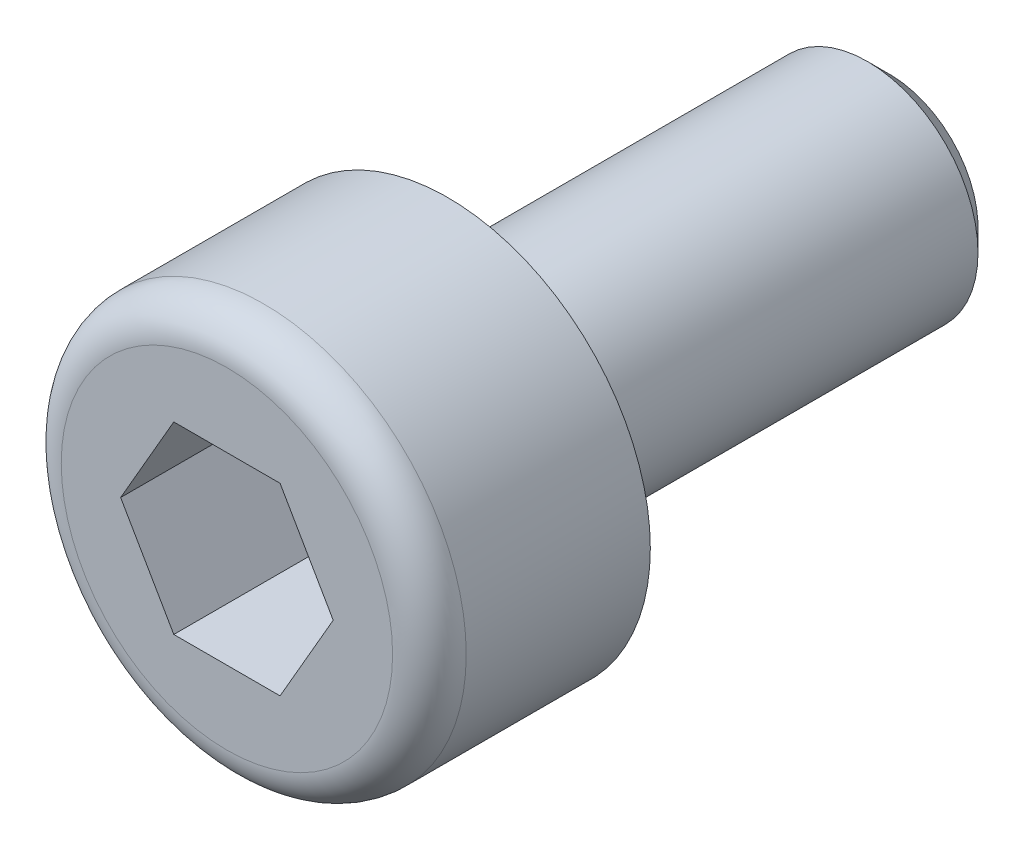
ISO-10303-21;
HEADER;
FILE_DESCRIPTION(('STEP AP214'),'2;1');
FILE_NAME('part.step','',(''),(''),'','','');
FILE_SCHEMA(('AUTOMOTIVE_DESIGN { 1 0 10303 214 1 1 1 1 }'));
ENDSEC;
DATA;
#1=APPLICATION_CONTEXT('core data for automotive mechanical design processes');
#2=APPLICATION_PROTOCOL_DEFINITION('international standard','automotive_design',2000,#1);
#3=PRODUCT_CONTEXT('',#1,'mechanical');
#4=PRODUCT('Part','Part','',(#3));
#5=PRODUCT_RELATED_PRODUCT_CATEGORY('part','',(#4));
#6=PRODUCT_DEFINITION_FORMATION('','',#4);
#7=PRODUCT_DEFINITION_CONTEXT('part definition',#1,'design');
#8=PRODUCT_DEFINITION('design','',#6,#7);
#9=PRODUCT_DEFINITION_SHAPE('','',#8);
#10=(LENGTH_UNIT() NAMED_UNIT(*) SI_UNIT(.MILLI.,.METRE.));
#11=(NAMED_UNIT(*) PLANE_ANGLE_UNIT() SI_UNIT($,.RADIAN.));
#12=(NAMED_UNIT(*) SI_UNIT($,.STERADIAN.) SOLID_ANGLE_UNIT());
#13=UNCERTAINTY_MEASURE_WITH_UNIT(LENGTH_MEASURE(1.E-05),#10,'distance_accuracy_value','');
#14=(GEOMETRIC_REPRESENTATION_CONTEXT(3) GLOBAL_UNCERTAINTY_ASSIGNED_CONTEXT((#13)) GLOBAL_UNIT_ASSIGNED_CONTEXT((#10,
#11,#12)) REPRESENTATION_CONTEXT('',''));
#15=CARTESIAN_POINT('',(0.,0.,0.));
#16=DIRECTION('',(0.,0.,1.));
#17=DIRECTION('',(1.,0.,0.));
#18=AXIS2_PLACEMENT_3D('',#15,#16,#17);
#19=CARTESIAN_POINT('',(0.,0.,0.));
#20=DIRECTION('',(0.,0.,1.));
#21=DIRECTION('',(1.,0.,0.));
#22=AXIS2_PLACEMENT_3D('',#19,#20,#21);
#23=PLANE('',#22);
#24=CARTESIAN_POINT('',(0.,0.,0.));
#25=DIRECTION('',(0.,0.,1.));
#26=DIRECTION('',(1.,0.,0.));
#27=AXIS2_PLACEMENT_3D('',#24,#25,#26);
#28=CIRCLE('',#27,2.75);
#29=CARTESIAN_POINT('',(2.75,0.,0.));
#30=VERTEX_POINT('',#29);
#31=EDGE_CURVE('E138',#30,#30,#28,.T.);
#32=ORIENTED_EDGE('',*,*,#31,.F.);
#33=EDGE_LOOP('',(#32));
#34=FACE_BOUND('',#33,.T.);
#35=CARTESIAN_POINT('',(0.,0.,0.));
#36=DIRECTION('',(0.,0.,1.));
#37=DIRECTION('',(1.,0.,0.));
#38=AXIS2_PLACEMENT_3D('',#35,#36,#37);
#39=CIRCLE('',#38,1.5);
#40=CARTESIAN_POINT('',(1.5,0.,0.));
#41=VERTEX_POINT('',#40);
#42=EDGE_CURVE('E146',#41,#41,#39,.F.);
#43=ORIENTED_EDGE('',*,*,#42,.F.);
#44=EDGE_LOOP('',(#43));
#45=FACE_BOUND('',#44,.T.);
#46=ADVANCED_FACE('F36',(#34,#45),#23,.F.);
#47=CARTESIAN_POINT('',(0.,0.,3.));
#48=DIRECTION('',(0.,0.,-1.));
#49=DIRECTION('',(-1.,0.,0.));
#50=AXIS2_PLACEMENT_3D('',#47,#48,#49);
#51=CYLINDRICAL_SURFACE('',#50,2.75);
#52=CARTESIAN_POINT('',(0.,0.,2.5));
#53=DIRECTION('',(0.,0.,1.));
#54=DIRECTION('',(1.,0.,0.));
#55=AXIS2_PLACEMENT_3D('',#52,#53,#54);
#56=CIRCLE('',#55,2.75);
#57=CARTESIAN_POINT('',(2.75,0.,2.5));
#58=VERTEX_POINT('',#57);
#59=EDGE_CURVE('E11',#58,#58,#56,.F.);
#60=ORIENTED_EDGE('',*,*,#59,.T.);
#61=EDGE_LOOP('',(#60));
#62=FACE_BOUND('',#61,.T.);
#63=ORIENTED_EDGE('',*,*,#31,.T.);
#64=EDGE_LOOP('',(#63));
#65=FACE_BOUND('',#64,.T.);
#66=ADVANCED_FACE('F170',(#62,#65),#51,.T.);
#67=CARTESIAN_POINT('',(0.,0.,3.));
#68=DIRECTION('',(0.,0.,1.));
#69=DIRECTION('',(1.,0.,0.));
#70=AXIS2_PLACEMENT_3D('',#67,#68,#69);
#71=PLANE('',#70);
#72=CARTESIAN_POINT('',(0.,0.,3.));
#73=DIRECTION('',(0.,0.,1.));
#74=DIRECTION('',(1.,0.,0.));
#75=AXIS2_PLACEMENT_3D('',#72,#73,#74);
#76=CIRCLE('',#75,2.25);
#77=CARTESIAN_POINT('',(2.25,0.,3.));
#78=VERTEX_POINT('',#77);
#79=EDGE_CURVE('E44',#78,#78,#76,.T.);
#80=ORIENTED_EDGE('',*,*,#79,.T.);
#81=EDGE_LOOP('',(#80));
#82=FACE_BOUND('',#81,.T.);
#83=DIRECTION('',(-0.5,-0.866025403784439,0.));
#84=VECTOR('',#83,1.);
#85=CARTESIAN_POINT('',(-0.721687836487034,1.25,3.));
#86=LINE('',#85,#84);
#87=CARTESIAN_POINT('',(-0.721687836487034,1.25,3.));
#88=VERTEX_POINT('',#87);
#89=CARTESIAN_POINT('',(-1.44337567297407,0.,3.));
#90=VERTEX_POINT('',#89);
#91=EDGE_CURVE('E51',#88,#90,#86,.T.);
#92=ORIENTED_EDGE('',*,*,#91,.F.);
#93=DIRECTION('',(-1.,0.,0.));
#94=VECTOR('',#93,1.);
#95=CARTESIAN_POINT('',(0.721687836487032,1.25,3.));
#96=LINE('',#95,#94);
#97=CARTESIAN_POINT('',(0.721687836487032,1.25,3.));
#98=VERTEX_POINT('',#97);
#99=EDGE_CURVE('E134',#98,#88,#96,.T.);
#100=ORIENTED_EDGE('',*,*,#99,.F.);
#101=DIRECTION('',(-0.5,0.866025403784439,0.));
#102=VECTOR('',#101,1.);
#103=CARTESIAN_POINT('',(1.44337567297406,0.,3.));
#104=LINE('',#103,#102);
#105=CARTESIAN_POINT('',(1.44337567297406,0.,3.));
#106=VERTEX_POINT('',#105);
#107=EDGE_CURVE('E132',#106,#98,#104,.T.);
#108=ORIENTED_EDGE('',*,*,#107,.F.);
#109=DIRECTION('',(0.5,0.866025403784439,0.));
#110=VECTOR('',#109,1.);
#111=CARTESIAN_POINT('',(0.721687836487031,-1.25,3.));
#112=LINE('',#111,#110);
#113=CARTESIAN_POINT('',(0.721687836487031,-1.25,3.));
#114=VERTEX_POINT('',#113);
#115=EDGE_CURVE('E99',#114,#106,#112,.T.);
#116=ORIENTED_EDGE('',*,*,#115,.F.);
#117=DIRECTION('',(1.,0.,0.));
#118=VECTOR('',#117,1.);
#119=CARTESIAN_POINT('',(-0.721687836487034,-1.25,3.));
#120=LINE('',#119,#118);
#121=CARTESIAN_POINT('',(-0.721687836487034,-1.25,3.));
#122=VERTEX_POINT('',#121);
#123=EDGE_CURVE('E128',#122,#114,#120,.T.);
#124=ORIENTED_EDGE('',*,*,#123,.F.);
#125=DIRECTION('',(0.5,-0.866025403784439,0.));
#126=VECTOR('',#125,1.);
#127=CARTESIAN_POINT('',(-1.44337567297407,0.,3.));
#128=LINE('',#127,#126);
#129=EDGE_CURVE('E125',#90,#122,#128,.T.);
#130=ORIENTED_EDGE('',*,*,#129,.F.);
#131=EDGE_LOOP('',(#92,#100,#108,#116,#124,#130));
#132=FACE_BOUND('',#131,.T.);
#133=ADVANCED_FACE('F157',(#82,#132),#71,.T.);
#134=CARTESIAN_POINT('',(-0.721687836487034,1.25,1.));
#135=DIRECTION('',(-0.866025403784439,0.5,0.));
#136=DIRECTION('',(-0.5,-0.866025403784439,0.));
#137=AXIS2_PLACEMENT_3D('',#134,#135,#136);
#138=PLANE('',#137);
#139=ORIENTED_EDGE('',*,*,#91,.T.);
#140=DIRECTION('',(0.,0.,1.));
#141=VECTOR('',#140,1.);
#142=CARTESIAN_POINT('',(-1.44337567297407,0.,1.));
#143=LINE('',#142,#141);
#144=CARTESIAN_POINT('',(-1.44337567297407,0.,1.));
#145=VERTEX_POINT('',#144);
#146=EDGE_CURVE('E81',#145,#90,#143,.T.);
#147=ORIENTED_EDGE('',*,*,#146,.F.);
#148=DIRECTION('',(-0.5,-0.866025403784439,0.));
#149=VECTOR('',#148,1.);
#150=CARTESIAN_POINT('',(-0.721687836487034,1.25,1.));
#151=LINE('',#150,#149);
#152=CARTESIAN_POINT('',(-0.721687836487034,1.25,1.));
#153=VERTEX_POINT('',#152);
#154=EDGE_CURVE('E136',#153,#145,#151,.T.);
#155=ORIENTED_EDGE('',*,*,#154,.F.);
#156=DIRECTION('',(0.,0.,1.));
#157=VECTOR('',#156,1.);
#158=CARTESIAN_POINT('',(-0.721687836487034,1.25,1.));
#159=LINE('',#158,#157);
#160=EDGE_CURVE('E59',#153,#88,#159,.T.);
#161=ORIENTED_EDGE('',*,*,#160,.T.);
#162=EDGE_LOOP('',(#139,#147,#155,#161));
#163=FACE_BOUND('',#162,.T.);
#164=ADVANCED_FACE('F183',(#163),#138,.F.);
#165=CARTESIAN_POINT('',(0.721687836487032,1.25,1.));
#166=DIRECTION('',(0.,1.,0.));
#167=DIRECTION('',(-1.,0.,0.));
#168=AXIS2_PLACEMENT_3D('',#165,#166,#167);
#169=PLANE('',#168);
#170=ORIENTED_EDGE('',*,*,#99,.T.);
#171=ORIENTED_EDGE('',*,*,#160,.F.);
#172=DIRECTION('',(-1.,0.,0.));
#173=VECTOR('',#172,1.);
#174=CARTESIAN_POINT('',(0.721687836487032,1.25,1.));
#175=LINE('',#174,#173);
#176=CARTESIAN_POINT('',(0.721687836487032,1.25,1.));
#177=VERTEX_POINT('',#176);
#178=EDGE_CURVE('E111',#177,#153,#175,.T.);
#179=ORIENTED_EDGE('',*,*,#178,.F.);
#180=DIRECTION('',(0.,0.,1.));
#181=VECTOR('',#180,1.);
#182=CARTESIAN_POINT('',(0.721687836487032,1.25,1.));
#183=LINE('',#182,#181);
#184=EDGE_CURVE('E103',#177,#98,#183,.T.);
#185=ORIENTED_EDGE('',*,*,#184,.T.);
#186=EDGE_LOOP('',(#170,#171,#179,#185));
#187=FACE_BOUND('',#186,.T.);
#188=ADVANCED_FACE('F186',(#187),#169,.F.);
#189=CARTESIAN_POINT('',(1.44337567297406,0.,1.));
#190=DIRECTION('',(0.866025403784439,0.5,0.));
#191=DIRECTION('',(-0.5,0.866025403784439,0.));
#192=AXIS2_PLACEMENT_3D('',#189,#190,#191);
#193=PLANE('',#192);
#194=ORIENTED_EDGE('',*,*,#107,.T.);
#195=ORIENTED_EDGE('',*,*,#184,.F.);
#196=DIRECTION('',(-0.5,0.866025403784439,0.));
#197=VECTOR('',#196,1.);
#198=CARTESIAN_POINT('',(1.44337567297406,0.,1.));
#199=LINE('',#198,#197);
#200=CARTESIAN_POINT('',(1.44337567297406,0.,1.));
#201=VERTEX_POINT('',#200);
#202=EDGE_CURVE('E107',#201,#177,#199,.T.);
#203=ORIENTED_EDGE('',*,*,#202,.F.);
#204=DIRECTION('',(0.,0.,1.));
#205=VECTOR('',#204,1.);
#206=CARTESIAN_POINT('',(1.44337567297406,0.,1.));
#207=LINE('',#206,#205);
#208=EDGE_CURVE('E92',#201,#106,#207,.T.);
#209=ORIENTED_EDGE('',*,*,#208,.T.);
#210=EDGE_LOOP('',(#194,#195,#203,#209));
#211=FACE_BOUND('',#210,.T.);
#212=ADVANCED_FACE('F108',(#211),#193,.F.);
#213=CARTESIAN_POINT('',(0.721687836487031,-1.25,1.));
#214=DIRECTION('',(0.866025403784439,-0.5,0.));
#215=DIRECTION('',(0.5,0.866025403784439,0.));
#216=AXIS2_PLACEMENT_3D('',#213,#214,#215);
#217=PLANE('',#216);
#218=ORIENTED_EDGE('',*,*,#115,.T.);
#219=ORIENTED_EDGE('',*,*,#208,.F.);
#220=DIRECTION('',(0.5,0.866025403784439,0.));
#221=VECTOR('',#220,1.);
#222=CARTESIAN_POINT('',(0.721687836487031,-1.25,1.));
#223=LINE('',#222,#221);
#224=CARTESIAN_POINT('',(0.721687836487031,-1.25,1.));
#225=VERTEX_POINT('',#224);
#226=EDGE_CURVE('E96',#225,#201,#223,.T.);
#227=ORIENTED_EDGE('',*,*,#226,.F.);
#228=DIRECTION('',(0.,0.,1.));
#229=VECTOR('',#228,1.);
#230=CARTESIAN_POINT('',(0.721687836487031,-1.25,1.));
#231=LINE('',#230,#229);
#232=EDGE_CURVE('E104',#225,#114,#231,.T.);
#233=ORIENTED_EDGE('',*,*,#232,.T.);
#234=EDGE_LOOP('',(#218,#219,#227,#233));
#235=FACE_BOUND('',#234,.T.);
#236=ADVANCED_FACE('F94',(#235),#217,.F.);
#237=CARTESIAN_POINT('',(-0.721687836487034,-1.25,1.));
#238=DIRECTION('',(0.,-1.,0.));
#239=DIRECTION('',(1.,0.,0.));
#240=AXIS2_PLACEMENT_3D('',#237,#238,#239);
#241=PLANE('',#240);
#242=ORIENTED_EDGE('',*,*,#123,.T.);
#243=ORIENTED_EDGE('',*,*,#232,.F.);
#244=DIRECTION('',(1.,0.,0.));
#245=VECTOR('',#244,1.);
#246=CARTESIAN_POINT('',(-0.721687836487034,-1.25,1.));
#247=LINE('',#246,#245);
#248=CARTESIAN_POINT('',(-0.721687836487034,-1.25,1.));
#249=VERTEX_POINT('',#248);
#250=EDGE_CURVE('E117',#249,#225,#247,.T.);
#251=ORIENTED_EDGE('',*,*,#250,.F.);
#252=DIRECTION('',(0.,0.,1.));
#253=VECTOR('',#252,1.);
#254=CARTESIAN_POINT('',(-0.721687836487034,-1.25,1.));
#255=LINE('',#254,#253);
#256=EDGE_CURVE('E141',#249,#122,#255,.T.);
#257=ORIENTED_EDGE('',*,*,#256,.T.);
#258=EDGE_LOOP('',(#242,#243,#251,#257));
#259=FACE_BOUND('',#258,.T.);
#260=ADVANCED_FACE('F190',(#259),#241,.F.);
#261=CARTESIAN_POINT('',(-1.44337567297407,0.,1.));
#262=DIRECTION('',(-0.866025403784439,-0.5,0.));
#263=DIRECTION('',(0.5,-0.866025403784439,0.));
#264=AXIS2_PLACEMENT_3D('',#261,#262,#263);
#265=PLANE('',#264);
#266=ORIENTED_EDGE('',*,*,#129,.T.);
#267=ORIENTED_EDGE('',*,*,#256,.F.);
#268=DIRECTION('',(0.5,-0.866025403784439,0.));
#269=VECTOR('',#268,1.);
#270=CARTESIAN_POINT('',(-1.44337567297407,0.,1.));
#271=LINE('',#270,#269);
#272=EDGE_CURVE('E119',#145,#249,#271,.T.);
#273=ORIENTED_EDGE('',*,*,#272,.F.);
#274=ORIENTED_EDGE('',*,*,#146,.T.);
#275=EDGE_LOOP('',(#266,#267,#273,#274));
#276=FACE_BOUND('',#275,.T.);
#277=ADVANCED_FACE('F187',(#276),#265,.F.);
#278=CARTESIAN_POINT('',(0.,0.,1.));
#279=DIRECTION('',(0.,0.,1.));
#280=DIRECTION('',(1.,0.,0.));
#281=AXIS2_PLACEMENT_3D('',#278,#279,#280);
#282=PLANE('',#281);
#283=ORIENTED_EDGE('',*,*,#154,.T.);
#284=ORIENTED_EDGE('',*,*,#272,.T.);
#285=ORIENTED_EDGE('',*,*,#250,.T.);
#286=ORIENTED_EDGE('',*,*,#226,.T.);
#287=ORIENTED_EDGE('',*,*,#202,.T.);
#288=ORIENTED_EDGE('',*,*,#178,.T.);
#289=EDGE_LOOP('',(#283,#284,#285,#286,#287,#288));
#290=FACE_BOUND('',#289,.T.);
#291=ADVANCED_FACE('F114',(#290),#282,.T.);
#292=CARTESIAN_POINT('',(0.,0.,-6.));
#293=DIRECTION('',(0.,0.,1.));
#294=DIRECTION('',(1.,0.,0.));
#295=AXIS2_PLACEMENT_3D('',#292,#293,#294);
#296=CYLINDRICAL_SURFACE('',#295,1.5);
#297=CARTESIAN_POINT('',(0.,0.,-5.7));
#298=DIRECTION('',(0.,0.,-1.));
#299=DIRECTION('',(-1.,0.,0.));
#300=AXIS2_PLACEMENT_3D('',#297,#298,#299);
#301=CIRCLE('',#300,1.5);
#302=CARTESIAN_POINT('',(-1.5,0.,-5.7));
#303=VERTEX_POINT('',#302);
#304=EDGE_CURVE('E152',#303,#303,#301,.F.);
#305=ORIENTED_EDGE('',*,*,#304,.T.);
#306=EDGE_LOOP('',(#305));
#307=FACE_BOUND('',#306,.T.);
#308=ORIENTED_EDGE('',*,*,#42,.T.);
#309=EDGE_LOOP('',(#308));
#310=FACE_BOUND('',#309,.T.);
#311=ADVANCED_FACE('F203',(#307,#310),#296,.T.);
#312=CARTESIAN_POINT('',(0.,0.,-6.));
#313=DIRECTION('',(0.,0.,-1.));
#314=DIRECTION('',(-1.,0.,0.));
#315=AXIS2_PLACEMENT_3D('',#312,#313,#314);
#316=PLANE('',#315);
#317=CARTESIAN_POINT('',(0.,0.,-6.));
#318=DIRECTION('',(0.,0.,-1.));
#319=DIRECTION('',(-1.,0.,0.));
#320=AXIS2_PLACEMENT_3D('',#317,#318,#319);
#321=CIRCLE('',#320,1.2);
#322=CARTESIAN_POINT('',(-1.2,0.,-6.));
#323=VERTEX_POINT('',#322);
#324=EDGE_CURVE('E149',#323,#323,#321,.T.);
#325=ORIENTED_EDGE('',*,*,#324,.T.);
#326=EDGE_LOOP('',(#325));
#327=FACE_BOUND('',#326,.T.);
#328=ADVANCED_FACE('F166',(#327),#316,.T.);
#329=CARTESIAN_POINT('',(0.,0.,-6.));
#330=DIRECTION('',(0.,0.,1.));
#331=DIRECTION('',(1.,0.,0.));
#332=AXIS2_PLACEMENT_3D('',#329,#330,#331);
#333=CONICAL_SURFACE('',#332,1.2,0.785398163397447);
#334=ORIENTED_EDGE('',*,*,#304,.F.);
#335=EDGE_LOOP('',(#334));
#336=FACE_BOUND('',#335,.T.);
#337=ORIENTED_EDGE('',*,*,#324,.F.);
#338=EDGE_LOOP('',(#337));
#339=FACE_BOUND('',#338,.T.);
#340=ADVANCED_FACE('F161',(#336,#339),#333,.T.);
#341=CARTESIAN_POINT('',(0.,0.,2.5));
#342=DIRECTION('',(0.,0.,1.));
#343=DIRECTION('',(1.,0.,0.));
#344=AXIS2_PLACEMENT_3D('',#341,#342,#343);
#345=TOROIDAL_SURFACE('',#344,2.25,0.5);
#346=ORIENTED_EDGE('',*,*,#59,.F.);
#347=EDGE_LOOP('',(#346));
#348=FACE_BOUND('',#347,.T.);
#349=ORIENTED_EDGE('',*,*,#79,.F.);
#350=EDGE_LOOP('',(#349));
#351=FACE_BOUND('',#350,.T.);
#352=ADVANCED_FACE('F38',(#348,#351),#345,.T.);
#353=CLOSED_SHELL('',(#46,#66,#133,#164,#188,#212,#236,#260,#277,#291,#311,#328,#340,#352));
#354=MANIFOLD_SOLID_BREP('B2',#353);
#355=ADVANCED_BREP_SHAPE_REPRESENTATION('',(#18,#354),#14);
#356=SHAPE_DEFINITION_REPRESENTATION(#9,#355);
ENDSEC;
END-ISO-10303-21;
